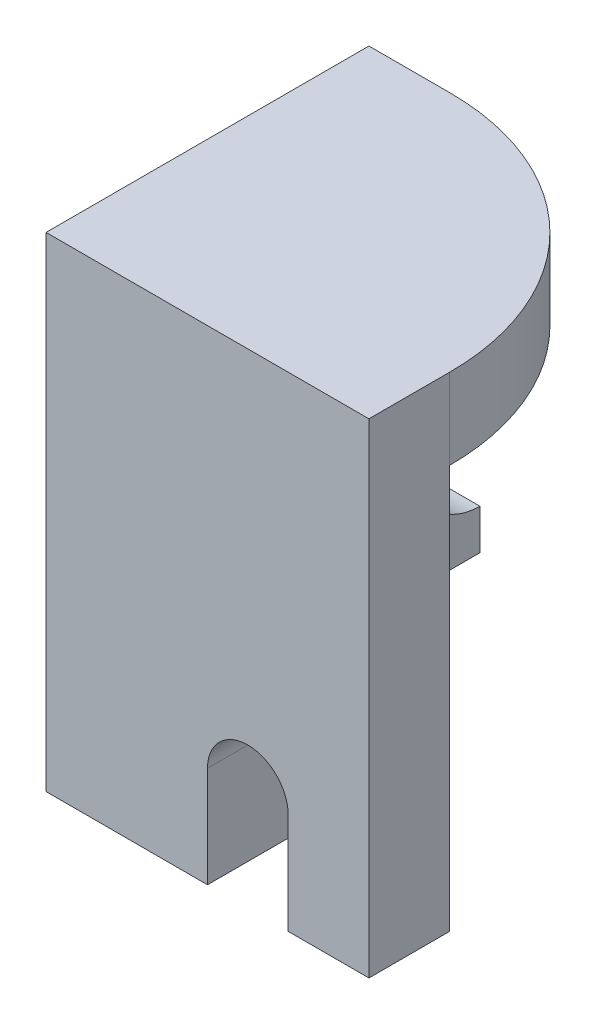
ISO-10303-21;
HEADER;
FILE_DESCRIPTION(('STEP AP214'),'2;1');
FILE_NAME('part.step','',(''),(''),'','','');
FILE_SCHEMA(('AUTOMOTIVE_DESIGN { 1 0 10303 214 1 1 1 1 }'));
ENDSEC;
DATA;
#1=APPLICATION_CONTEXT('core data for automotive mechanical design processes');
#2=APPLICATION_PROTOCOL_DEFINITION('international standard','automotive_design',2000,#1);
#3=PRODUCT_CONTEXT('',#1,'mechanical');
#4=PRODUCT('Part','Part','',(#3));
#5=PRODUCT_RELATED_PRODUCT_CATEGORY('part','',(#4));
#6=PRODUCT_DEFINITION_FORMATION('','',#4);
#7=PRODUCT_DEFINITION_CONTEXT('part definition',#1,'design');
#8=PRODUCT_DEFINITION('design','',#6,#7);
#9=PRODUCT_DEFINITION_SHAPE('','',#8);
#10=(LENGTH_UNIT() NAMED_UNIT(*) SI_UNIT(.MILLI.,.METRE.));
#11=(NAMED_UNIT(*) PLANE_ANGLE_UNIT() SI_UNIT($,.RADIAN.));
#12=(NAMED_UNIT(*) SI_UNIT($,.STERADIAN.) SOLID_ANGLE_UNIT());
#13=UNCERTAINTY_MEASURE_WITH_UNIT(LENGTH_MEASURE(1.E-05),#10,'distance_accuracy_value','');
#14=(GEOMETRIC_REPRESENTATION_CONTEXT(3) GLOBAL_UNCERTAINTY_ASSIGNED_CONTEXT((#13)) GLOBAL_UNIT_ASSIGNED_CONTEXT((#10,
#11,#12)) REPRESENTATION_CONTEXT('',''));
#15=CARTESIAN_POINT('',(0.,0.,0.));
#16=DIRECTION('',(0.,0.,1.));
#17=DIRECTION('',(1.,0.,0.));
#18=AXIS2_PLACEMENT_3D('',#15,#16,#17);
#19=CARTESIAN_POINT('',(0.,0.,-12.));
#20=DIRECTION('',(0.,0.,1.));
#21=DIRECTION('',(1.,0.,0.));
#22=AXIS2_PLACEMENT_3D('',#19,#20,#21);
#23=PLANE('',#22);
#24=DIRECTION('',(0.,1.,0.));
#25=VECTOR('',#24,1.);
#26=CARTESIAN_POINT('',(-32.,0.,-12.));
#27=LINE('',#26,#25);
#28=CARTESIAN_POINT('',(-32.,-40.,-12.));
#29=VERTEX_POINT('',#28);
#30=CARTESIAN_POINT('',(-32.,-32.,-12.));
#31=VERTEX_POINT('',#30);
#32=EDGE_CURVE('E333',#29,#31,#27,.T.);
#33=ORIENTED_EDGE('',*,*,#32,.T.);
#34=DIRECTION('',(1.,0.,0.));
#35=VECTOR('',#34,1.);
#36=CARTESIAN_POINT('',(-41.,-32.,-12.));
#37=LINE('',#36,#35);
#38=CARTESIAN_POINT('',(9.99999999999998,-32.,-12.));
#39=VERTEX_POINT('',#38);
#40=EDGE_CURVE('E11',#31,#39,#37,.T.);
#41=ORIENTED_EDGE('',*,*,#40,.T.);
#42=DIRECTION('',(0.,-1.,0.));
#43=VECTOR('',#42,1.);
#44=CARTESIAN_POINT('',(9.99999999999999,0.,-12.));
#45=LINE('',#44,#43);
#46=CARTESIAN_POINT('',(9.99999999999998,-40.,-12.));
#47=VERTEX_POINT('',#46);
#48=EDGE_CURVE('E194',#39,#47,#45,.T.);
#49=ORIENTED_EDGE('',*,*,#48,.T.);
#50=DIRECTION('',(-1.,0.,0.));
#51=VECTOR('',#50,1.);
#52=CARTESIAN_POINT('',(-32.,-40.,-12.));
#53=LINE('',#52,#51);
#54=CARTESIAN_POINT('',(-20.,-40.,-12.));
#55=VERTEX_POINT('',#54);
#56=EDGE_CURVE('E189',#47,#55,#53,.T.);
#57=ORIENTED_EDGE('',*,*,#56,.T.);
#58=DIRECTION('',(-1.,0.,0.));
#59=VECTOR('',#58,1.);
#60=CARTESIAN_POINT('',(-20.,-40.,-12.));
#61=LINE('',#60,#59);
#62=EDGE_CURVE('E161',#55,#29,#61,.T.);
#63=ORIENTED_EDGE('',*,*,#62,.T.);
#64=EDGE_LOOP('',(#33,#41,#49,#57,#63));
#65=FACE_BOUND('',#64,.T.);
#66=ADVANCED_FACE('F43',(#65),#23,.F.);
#67=CARTESIAN_POINT('',(-16.,0.,16.));
#68=DIRECTION('',(0.,1.,0.));
#69=DIRECTION('',(0.,0.,1.));
#70=AXIS2_PLACEMENT_3D('',#67,#68,#69);
#71=PLANE('',#70);
#72=DIRECTION('',(0.,0.,1.));
#73=VECTOR('',#72,1.);
#74=CARTESIAN_POINT('',(9.99999999999999,0.,-12.));
#75=LINE('',#74,#73);
#76=CARTESIAN_POINT('',(9.99999999999998,0.,-12.));
#77=VERTEX_POINT('',#76);
#78=CARTESIAN_POINT('',(9.99999999999998,0.,16.));
#79=VERTEX_POINT('',#78);
#80=EDGE_CURVE('E67',#77,#79,#75,.T.);
#81=ORIENTED_EDGE('',*,*,#80,.F.);
#82=DIRECTION('',(1.,0.,0.));
#83=VECTOR('',#82,1.);
#84=CARTESIAN_POINT('',(-32.,0.,-12.));
#85=LINE('',#84,#83);
#86=CARTESIAN_POINT('',(-32.,0.,-12.));
#87=VERTEX_POINT('',#86);
#88=EDGE_CURVE('E336',#87,#77,#85,.T.);
#89=ORIENTED_EDGE('',*,*,#88,.F.);
#90=DIRECTION('',(0.,0.,1.));
#91=VECTOR('',#90,1.);
#92=CARTESIAN_POINT('',(-32.,0.,-32.));
#93=LINE('',#92,#91);
#94=CARTESIAN_POINT('',(-32.,0.,-32.));
#95=VERTEX_POINT('',#94);
#96=EDGE_CURVE('E277',#95,#87,#93,.T.);
#97=ORIENTED_EDGE('',*,*,#96,.F.);
#98=DIRECTION('',(-1.,0.,0.));
#99=VECTOR('',#98,1.);
#100=CARTESIAN_POINT('',(-32.,0.,-32.));
#101=LINE('',#100,#99);
#102=CARTESIAN_POINT('',(-16.,0.,-32.));
#103=VERTEX_POINT('',#102);
#104=EDGE_CURVE('E292',#103,#95,#101,.T.);
#105=ORIENTED_EDGE('',*,*,#104,.F.);
#106=CARTESIAN_POINT('',(-16.,0.,16.));
#107=DIRECTION('',(0.,1.,0.));
#108=DIRECTION('',(0.,0.,1.));
#109=AXIS2_PLACEMENT_3D('',#106,#107,#108);
#110=CIRCLE('',#109,48.);
#111=CARTESIAN_POINT('',(32.,0.,16.));
#112=VERTEX_POINT('',#111);
#113=EDGE_CURVE('E271',#112,#103,#110,.T.);
#114=ORIENTED_EDGE('',*,*,#113,.F.);
#115=DIRECTION('',(1.,0.,0.));
#116=VECTOR('',#115,1.);
#117=CARTESIAN_POINT('',(32.,0.,16.));
#118=LINE('',#117,#116);
#119=EDGE_CURVE('E245',#79,#112,#118,.T.);
#120=ORIENTED_EDGE('',*,*,#119,.F.);
#121=EDGE_LOOP('',(#81,#89,#97,#105,#114,#120));
#122=FACE_BOUND('',#121,.T.);
#123=ADVANCED_FACE('F369',(#122),#71,.F.);
#124=CARTESIAN_POINT('',(32.,-80.,16.));
#125=DIRECTION('',(0.,0.,1.));
#126=DIRECTION('',(1.,0.,0.));
#127=AXIS2_PLACEMENT_3D('',#124,#125,#126);
#128=PLANE('',#127);
#129=DIRECTION('',(1.,0.,0.));
#130=VECTOR('',#129,1.);
#131=CARTESIAN_POINT('',(32.,-80.,16.));
#132=LINE('',#131,#130);
#133=CARTESIAN_POINT('',(-20.,-80.,16.));
#134=VERTEX_POINT('',#133);
#135=CARTESIAN_POINT('',(0.,-80.,16.));
#136=VERTEX_POINT('',#135);
#137=EDGE_CURVE('E265',#134,#136,#132,.T.);
#138=ORIENTED_EDGE('',*,*,#137,.F.);
#139=DIRECTION('',(0.,1.,0.));
#140=VECTOR('',#139,1.);
#141=CARTESIAN_POINT('',(-20.,-80.,16.));
#142=LINE('',#141,#140);
#143=CARTESIAN_POINT('',(-20.,-40.,16.));
#144=VERTEX_POINT('',#143);
#145=EDGE_CURVE('E174',#134,#144,#142,.T.);
#146=ORIENTED_EDGE('',*,*,#145,.T.);
#147=DIRECTION('',(-1.,0.,0.));
#148=VECTOR('',#147,1.);
#149=CARTESIAN_POINT('',(-32.,-40.,16.));
#150=LINE('',#149,#148);
#151=CARTESIAN_POINT('',(9.99999999999998,-40.,16.));
#152=VERTEX_POINT('',#151);
#153=EDGE_CURVE('E190',#152,#144,#150,.T.);
#154=ORIENTED_EDGE('',*,*,#153,.F.);
#155=DIRECTION('',(0.,-1.,0.));
#156=VECTOR('',#155,1.);
#157=CARTESIAN_POINT('',(9.99999999999998,0.,16.));
#158=LINE('',#157,#156);
#159=EDGE_CURVE('E207',#79,#152,#158,.T.);
#160=ORIENTED_EDGE('',*,*,#159,.F.);
#161=ORIENTED_EDGE('',*,*,#119,.T.);
#162=DIRECTION('',(0.,1.,0.));
#163=VECTOR('',#162,1.);
#164=CARTESIAN_POINT('',(32.,-80.,16.));
#165=LINE('',#164,#163);
#166=CARTESIAN_POINT('',(32.,-80.,16.));
#167=VERTEX_POINT('',#166);
#168=EDGE_CURVE('E264',#167,#112,#165,.T.);
#169=ORIENTED_EDGE('',*,*,#168,.F.);
#170=CARTESIAN_POINT('',(16.,-80.,16.));
#171=VERTEX_POINT('',#170);
#172=EDGE_CURVE('E259',#171,#167,#132,.T.);
#173=ORIENTED_EDGE('',*,*,#172,.F.);
#174=DIRECTION('',(0.,-1.,0.));
#175=VECTOR('',#174,1.);
#176=CARTESIAN_POINT('',(16.,-80.,16.));
#177=LINE('',#176,#175);
#178=CARTESIAN_POINT('',(16.,-60.,16.));
#179=VERTEX_POINT('',#178);
#180=EDGE_CURVE('E216',#179,#171,#177,.T.);
#181=ORIENTED_EDGE('',*,*,#180,.F.);
#182=CARTESIAN_POINT('',(8.,-60.,16.));
#183=DIRECTION('',(0.,0.,-1.));
#184=DIRECTION('',(-1.,0.,0.));
#185=AXIS2_PLACEMENT_3D('',#182,#183,#184);
#186=CIRCLE('',#185,8.);
#187=CARTESIAN_POINT('',(0.,-60.,16.));
#188=VERTEX_POINT('',#187);
#189=EDGE_CURVE('E223',#188,#179,#186,.T.);
#190=ORIENTED_EDGE('',*,*,#189,.F.);
#191=DIRECTION('',(0.,1.,0.));
#192=VECTOR('',#191,1.);
#193=CARTESIAN_POINT('',(0.,-80.,16.));
#194=LINE('',#193,#192);
#195=EDGE_CURVE('E219',#136,#188,#194,.T.);
#196=ORIENTED_EDGE('',*,*,#195,.F.);
#197=EDGE_LOOP('',(#138,#146,#154,#160,#161,#169,#173,#181,#190,#196));
#198=FACE_BOUND('',#197,.T.);
#199=ADVANCED_FACE('F350',(#198),#128,.F.);
#200=CARTESIAN_POINT('',(0.,-80.,0.));
#201=DIRECTION('',(0.,1.,0.));
#202=DIRECTION('',(0.,0.,1.));
#203=AXIS2_PLACEMENT_3D('',#200,#201,#202);
#204=PLANE('',#203);
#205=DIRECTION('',(-1.,0.,0.));
#206=VECTOR('',#205,1.);
#207=CARTESIAN_POINT('',(32.,-80.,32.));
#208=LINE('',#207,#206);
#209=CARTESIAN_POINT('',(32.,-80.,32.));
#210=VERTEX_POINT('',#209);
#211=CARTESIAN_POINT('',(16.,-80.,32.));
#212=VERTEX_POINT('',#211);
#213=EDGE_CURVE('E251',#210,#212,#208,.T.);
#214=ORIENTED_EDGE('',*,*,#213,.T.);
#215=DIRECTION('',(0.,0.,-1.));
#216=VECTOR('',#215,1.);
#217=CARTESIAN_POINT('',(16.,-80.,0.));
#218=LINE('',#217,#216);
#219=EDGE_CURVE('E320',#212,#171,#218,.T.);
#220=ORIENTED_EDGE('',*,*,#219,.T.);
#221=ORIENTED_EDGE('',*,*,#172,.T.);
#222=DIRECTION('',(0.,0.,1.));
#223=VECTOR('',#222,1.);
#224=CARTESIAN_POINT('',(32.,-80.,32.));
#225=LINE('',#224,#223);
#226=EDGE_CURVE('E246',#167,#210,#225,.T.);
#227=ORIENTED_EDGE('',*,*,#226,.T.);
#228=EDGE_LOOP('',(#214,#220,#221,#227));
#229=FACE_BOUND('',#228,.T.);
#230=ADVANCED_FACE('F394',(#229),#204,.F.);
#231=CARTESIAN_POINT('',(32.,16.,16.));
#232=DIRECTION('',(-1.,0.,0.));
#233=DIRECTION('',(0.,0.,1.));
#234=AXIS2_PLACEMENT_3D('',#231,#232,#233);
#235=PLANE('',#234);
#236=DIRECTION('',(0.,-1.,0.));
#237=VECTOR('',#236,1.);
#238=CARTESIAN_POINT('',(32.,16.,32.));
#239=LINE('',#238,#237);
#240=CARTESIAN_POINT('',(32.,16.,32.));
#241=VERTEX_POINT('',#240);
#242=EDGE_CURVE('E289',#241,#210,#239,.T.);
#243=ORIENTED_EDGE('',*,*,#242,.T.);
#244=ORIENTED_EDGE('',*,*,#226,.F.);
#245=ORIENTED_EDGE('',*,*,#168,.T.);
#246=DIRECTION('',(0.,-1.,0.));
#247=VECTOR('',#246,1.);
#248=CARTESIAN_POINT('',(32.,16.,16.));
#249=LINE('',#248,#247);
#250=CARTESIAN_POINT('',(32.,16.,16.));
#251=VERTEX_POINT('',#250);
#252=EDGE_CURVE('E312',#251,#112,#249,.T.);
#253=ORIENTED_EDGE('',*,*,#252,.F.);
#254=DIRECTION('',(0.,0.,-1.));
#255=VECTOR('',#254,1.);
#256=CARTESIAN_POINT('',(32.,16.,16.));
#257=LINE('',#256,#255);
#258=EDGE_CURVE('E272',#241,#251,#257,.T.);
#259=ORIENTED_EDGE('',*,*,#258,.F.);
#260=EDGE_LOOP('',(#243,#244,#245,#253,#259));
#261=FACE_BOUND('',#260,.T.);
#262=ADVANCED_FACE('F45',(#261),#235,.F.);
#263=CARTESIAN_POINT('',(-16.,16.,16.));
#264=DIRECTION('',(0.,-1.,0.));
#265=DIRECTION('',(0.,0.,-1.));
#266=AXIS2_PLACEMENT_3D('',#263,#264,#265);
#267=CYLINDRICAL_SURFACE('',#266,48.);
#268=ORIENTED_EDGE('',*,*,#113,.T.);
#269=DIRECTION('',(0.,-1.,0.));
#270=VECTOR('',#269,1.);
#271=CARTESIAN_POINT('',(-16.,16.,-32.));
#272=LINE('',#271,#270);
#273=CARTESIAN_POINT('',(-16.,16.,-32.));
#274=VERTEX_POINT('',#273);
#275=EDGE_CURVE('E308',#274,#103,#272,.T.);
#276=ORIENTED_EDGE('',*,*,#275,.F.);
#277=CARTESIAN_POINT('',(-16.,16.,16.));
#278=DIRECTION('',(0.,1.,0.));
#279=DIRECTION('',(0.,0.,1.));
#280=AXIS2_PLACEMENT_3D('',#277,#278,#279);
#281=CIRCLE('',#280,48.);
#282=EDGE_CURVE('E276',#251,#274,#281,.T.);
#283=ORIENTED_EDGE('',*,*,#282,.F.);
#284=ORIENTED_EDGE('',*,*,#252,.T.);
#285=EDGE_LOOP('',(#268,#276,#283,#284));
#286=FACE_BOUND('',#285,.T.);
#287=ADVANCED_FACE('F408',(#286),#267,.T.);
#288=CARTESIAN_POINT('',(-32.,16.,-32.));
#289=DIRECTION('',(0.,0.,1.));
#290=DIRECTION('',(1.,0.,0.));
#291=AXIS2_PLACEMENT_3D('',#288,#289,#290);
#292=PLANE('',#291);
#293=ORIENTED_EDGE('',*,*,#104,.T.);
#294=DIRECTION('',(0.,-1.,0.));
#295=VECTOR('',#294,1.);
#296=CARTESIAN_POINT('',(-32.,16.,-32.));
#297=LINE('',#296,#295);
#298=CARTESIAN_POINT('',(-32.,16.,-32.));
#299=VERTEX_POINT('',#298);
#300=EDGE_CURVE('E304',#299,#95,#297,.T.);
#301=ORIENTED_EDGE('',*,*,#300,.F.);
#302=DIRECTION('',(-1.,0.,0.));
#303=VECTOR('',#302,1.);
#304=CARTESIAN_POINT('',(-32.,16.,-32.));
#305=LINE('',#304,#303);
#306=EDGE_CURVE('E280',#274,#299,#305,.T.);
#307=ORIENTED_EDGE('',*,*,#306,.F.);
#308=ORIENTED_EDGE('',*,*,#275,.T.);
#309=EDGE_LOOP('',(#293,#301,#307,#308));
#310=FACE_BOUND('',#309,.T.);
#311=ADVANCED_FACE('F406',(#310),#292,.F.);
#312=CARTESIAN_POINT('',(-32.,16.,-32.));
#313=DIRECTION('',(1.,0.,0.));
#314=DIRECTION('',(0.,0.,-1.));
#315=AXIS2_PLACEMENT_3D('',#312,#313,#314);
#316=PLANE('',#315);
#317=CARTESIAN_POINT('',(-32.,-8.,-12.));
#318=VERTEX_POINT('',#317);
#319=EDGE_CURVE('E212',#318,#87,#27,.T.);
#320=ORIENTED_EDGE('',*,*,#319,.F.);
#321=CARTESIAN_POINT('',(-32.,-20.,-12.));
#322=DIRECTION('',(1.,0.,0.));
#323=DIRECTION('',(0.,0.,-1.));
#324=AXIS2_PLACEMENT_3D('',#321,#322,#323);
#325=CIRCLE('',#324,12.);
#326=EDGE_CURVE('E59',#318,#31,#325,.T.);
#327=ORIENTED_EDGE('',*,*,#326,.T.);
#328=ORIENTED_EDGE('',*,*,#32,.F.);
#329=DIRECTION('',(0.,-0.819231920519041,0.573462344363328));
#330=VECTOR('',#329,1.);
#331=CARTESIAN_POINT('',(-32.,-40.,-12.));
#332=LINE('',#331,#330);
#333=CARTESIAN_POINT('',(-32.,-80.,16.));
#334=VERTEX_POINT('',#333);
#335=EDGE_CURVE('E167',#29,#334,#332,.T.);
#336=ORIENTED_EDGE('',*,*,#335,.T.);
#337=DIRECTION('',(0.,0.,-1.));
#338=VECTOR('',#337,1.);
#339=CARTESIAN_POINT('',(-32.,-80.,32.));
#340=LINE('',#339,#338);
#341=CARTESIAN_POINT('',(-32.,-80.,32.));
#342=VERTEX_POINT('',#341);
#343=EDGE_CURVE('E255',#342,#334,#340,.T.);
#344=ORIENTED_EDGE('',*,*,#343,.F.);
#345=DIRECTION('',(0.,-1.,0.));
#346=VECTOR('',#345,1.);
#347=CARTESIAN_POINT('',(-32.,16.,32.));
#348=LINE('',#347,#346);
#349=CARTESIAN_POINT('',(-32.,16.,32.));
#350=VERTEX_POINT('',#349);
#351=EDGE_CURVE('E300',#350,#342,#348,.T.);
#352=ORIENTED_EDGE('',*,*,#351,.F.);
#353=DIRECTION('',(0.,0.,1.));
#354=VECTOR('',#353,1.);
#355=CARTESIAN_POINT('',(-32.,16.,-32.));
#356=LINE('',#355,#354);
#357=EDGE_CURVE('E283',#299,#350,#356,.T.);
#358=ORIENTED_EDGE('',*,*,#357,.F.);
#359=ORIENTED_EDGE('',*,*,#300,.T.);
#360=ORIENTED_EDGE('',*,*,#96,.T.);
#361=EDGE_LOOP('',(#320,#327,#328,#336,#344,#352,#358,#359,#360));
#362=FACE_BOUND('',#361,.T.);
#363=ADVANCED_FACE('F330',(#362),#316,.F.);
#364=CARTESIAN_POINT('',(-32.,16.,32.));
#365=DIRECTION('',(0.,0.,-1.));
#366=DIRECTION('',(-1.,0.,0.));
#367=AXIS2_PLACEMENT_3D('',#364,#365,#366);
#368=PLANE('',#367);
#369=CARTESIAN_POINT('',(8.,-60.,32.));
#370=DIRECTION('',(0.,0.,-1.));
#371=DIRECTION('',(-1.,0.,0.));
#372=AXIS2_PLACEMENT_3D('',#369,#370,#371);
#373=CIRCLE('',#372,8.);
#374=CARTESIAN_POINT('',(0.,-60.,32.));
#375=VERTEX_POINT('',#374);
#376=CARTESIAN_POINT('',(16.,-60.,32.));
#377=VERTEX_POINT('',#376);
#378=EDGE_CURVE('E241',#375,#377,#373,.T.);
#379=ORIENTED_EDGE('',*,*,#378,.T.);
#380=DIRECTION('',(0.,-1.,0.));
#381=VECTOR('',#380,1.);
#382=CARTESIAN_POINT('',(16.,16.,32.));
#383=LINE('',#382,#381);
#384=EDGE_CURVE('E237',#377,#212,#383,.T.);
#385=ORIENTED_EDGE('',*,*,#384,.T.);
#386=ORIENTED_EDGE('',*,*,#213,.F.);
#387=ORIENTED_EDGE('',*,*,#242,.F.);
#388=DIRECTION('',(1.,0.,0.));
#389=VECTOR('',#388,1.);
#390=CARTESIAN_POINT('',(-32.,16.,32.));
#391=LINE('',#390,#389);
#392=EDGE_CURVE('E286',#350,#241,#391,.T.);
#393=ORIENTED_EDGE('',*,*,#392,.F.);
#394=ORIENTED_EDGE('',*,*,#351,.T.);
#395=CARTESIAN_POINT('',(0.,-80.,32.));
#396=VERTEX_POINT('',#395);
#397=EDGE_CURVE('E250',#396,#342,#208,.T.);
#398=ORIENTED_EDGE('',*,*,#397,.F.);
#399=DIRECTION('',(0.,1.,0.));
#400=VECTOR('',#399,1.);
#401=CARTESIAN_POINT('',(0.,16.,32.));
#402=LINE('',#401,#400);
#403=EDGE_CURVE('E231',#396,#375,#402,.T.);
#404=ORIENTED_EDGE('',*,*,#403,.T.);
#405=EDGE_LOOP('',(#379,#385,#386,#387,#393,#394,#398,#404));
#406=FACE_BOUND('',#405,.T.);
#407=ADVANCED_FACE('F398',(#406),#368,.F.);
#408=CARTESIAN_POINT('',(-16.,16.,16.));
#409=DIRECTION('',(0.,1.,0.));
#410=DIRECTION('',(0.,0.,1.));
#411=AXIS2_PLACEMENT_3D('',#408,#409,#410);
#412=PLANE('',#411);
#413=ORIENTED_EDGE('',*,*,#258,.T.);
#414=ORIENTED_EDGE('',*,*,#282,.T.);
#415=ORIENTED_EDGE('',*,*,#306,.T.);
#416=ORIENTED_EDGE('',*,*,#357,.T.);
#417=ORIENTED_EDGE('',*,*,#392,.T.);
#418=EDGE_LOOP('',(#413,#414,#415,#416,#417));
#419=FACE_BOUND('',#418,.T.);
#420=ADVANCED_FACE('F393',(#419),#412,.T.);
#421=EDGE_CURVE('E260',#334,#134,#132,.T.);
#422=ORIENTED_EDGE('',*,*,#421,.T.);
#423=ORIENTED_EDGE('',*,*,#137,.T.);
#424=DIRECTION('',(0.,0.,1.));
#425=VECTOR('',#424,1.);
#426=CARTESIAN_POINT('',(0.,-80.,0.));
#427=LINE('',#426,#425);
#428=EDGE_CURVE('E316',#136,#396,#427,.T.);
#429=ORIENTED_EDGE('',*,*,#428,.T.);
#430=ORIENTED_EDGE('',*,*,#397,.T.);
#431=ORIENTED_EDGE('',*,*,#343,.T.);
#432=EDGE_LOOP('',(#422,#423,#429,#430,#431));
#433=FACE_BOUND('',#432,.T.);
#434=ADVANCED_FACE('F356',(#433),#204,.F.);
#435=CARTESIAN_POINT('',(7.99999999999999,-60.,96.));
#436=DIRECTION('',(0.,0.,-1.));
#437=DIRECTION('',(-1.,0.,0.));
#438=AXIS2_PLACEMENT_3D('',#435,#436,#437);
#439=CYLINDRICAL_SURFACE('',#438,8.);
#440=DIRECTION('',(0.,0.,-1.));
#441=VECTOR('',#440,1.);
#442=CARTESIAN_POINT('',(0.,-60.,96.));
#443=LINE('',#442,#441);
#444=EDGE_CURVE('E227',#375,#188,#443,.T.);
#445=ORIENTED_EDGE('',*,*,#444,.T.);
#446=ORIENTED_EDGE('',*,*,#189,.T.);
#447=DIRECTION('',(0.,0.,-1.));
#448=VECTOR('',#447,1.);
#449=CARTESIAN_POINT('',(16.,-60.,96.));
#450=LINE('',#449,#448);
#451=EDGE_CURVE('E228',#377,#179,#450,.T.);
#452=ORIENTED_EDGE('',*,*,#451,.F.);
#453=ORIENTED_EDGE('',*,*,#378,.F.);
#454=EDGE_LOOP('',(#445,#446,#452,#453));
#455=FACE_BOUND('',#454,.T.);
#456=ADVANCED_FACE('F380',(#455),#439,.F.);
#457=CARTESIAN_POINT('',(16.,-80.,96.));
#458=DIRECTION('',(1.,0.,0.));
#459=DIRECTION('',(0.,0.,-1.));
#460=AXIS2_PLACEMENT_3D('',#457,#458,#459);
#461=PLANE('',#460);
#462=ORIENTED_EDGE('',*,*,#451,.T.);
#463=ORIENTED_EDGE('',*,*,#180,.T.);
#464=ORIENTED_EDGE('',*,*,#219,.F.);
#465=ORIENTED_EDGE('',*,*,#384,.F.);
#466=EDGE_LOOP('',(#462,#463,#464,#465));
#467=FACE_BOUND('',#466,.T.);
#468=ADVANCED_FACE('F383',(#467),#461,.F.);
#469=CARTESIAN_POINT('',(0.,-80.,96.));
#470=DIRECTION('',(-1.,0.,0.));
#471=DIRECTION('',(0.,-1.,0.));
#472=AXIS2_PLACEMENT_3D('',#469,#470,#471);
#473=PLANE('',#472);
#474=ORIENTED_EDGE('',*,*,#428,.F.);
#475=ORIENTED_EDGE('',*,*,#195,.T.);
#476=ORIENTED_EDGE('',*,*,#444,.F.);
#477=ORIENTED_EDGE('',*,*,#403,.F.);
#478=EDGE_LOOP('',(#474,#475,#476,#477));
#479=FACE_BOUND('',#478,.T.);
#480=ADVANCED_FACE('F379',(#479),#473,.F.);
#481=CARTESIAN_POINT('',(9.99999999999999,0.,-12.));
#482=DIRECTION('',(-1.,0.,0.));
#483=DIRECTION('',(0.,0.,1.));
#484=AXIS2_PLACEMENT_3D('',#481,#482,#483);
#485=PLANE('',#484);
#486=ORIENTED_EDGE('',*,*,#48,.F.);
#487=CARTESIAN_POINT('',(9.99999999999998,-20.,-12.));
#488=DIRECTION('',(1.,0.,0.));
#489=DIRECTION('',(0.,0.,-1.));
#490=AXIS2_PLACEMENT_3D('',#487,#488,#489);
#491=CIRCLE('',#490,12.);
#492=CARTESIAN_POINT('',(9.99999999999999,-8.,-12.));
#493=VERTEX_POINT('',#492);
#494=EDGE_CURVE('E173',#493,#39,#491,.T.);
#495=ORIENTED_EDGE('',*,*,#494,.F.);
#496=EDGE_CURVE('E198',#77,#493,#45,.T.);
#497=ORIENTED_EDGE('',*,*,#496,.F.);
#498=ORIENTED_EDGE('',*,*,#80,.T.);
#499=ORIENTED_EDGE('',*,*,#159,.T.);
#500=DIRECTION('',(0.,0.,1.));
#501=VECTOR('',#500,1.);
#502=CARTESIAN_POINT('',(9.99999999999998,-40.,-12.));
#503=LINE('',#502,#501);
#504=EDGE_CURVE('E197',#47,#152,#503,.T.);
#505=ORIENTED_EDGE('',*,*,#504,.F.);
#506=EDGE_LOOP('',(#486,#495,#497,#498,#499,#505));
#507=FACE_BOUND('',#506,.T.);
#508=ADVANCED_FACE('F342',(#507),#485,.F.);
#509=CARTESIAN_POINT('',(-32.,-40.,-12.));
#510=DIRECTION('',(0.,1.,0.));
#511=DIRECTION('',(0.,0.,1.));
#512=AXIS2_PLACEMENT_3D('',#509,#510,#511);
#513=PLANE('',#512);
#514=ORIENTED_EDGE('',*,*,#153,.T.);
#515=DIRECTION('',(0.,0.,-1.));
#516=VECTOR('',#515,1.);
#517=CARTESIAN_POINT('',(-20.,-40.,16.));
#518=LINE('',#517,#516);
#519=EDGE_CURVE('E179',#144,#55,#518,.T.);
#520=ORIENTED_EDGE('',*,*,#519,.T.);
#521=ORIENTED_EDGE('',*,*,#56,.F.);
#522=ORIENTED_EDGE('',*,*,#504,.T.);
#523=EDGE_LOOP('',(#514,#520,#521,#522));
#524=FACE_BOUND('',#523,.T.);
#525=ADVANCED_FACE('F187',(#524),#513,.F.);
#526=ORIENTED_EDGE('',*,*,#496,.T.);
#527=DIRECTION('',(1.,0.,0.));
#528=VECTOR('',#527,1.);
#529=CARTESIAN_POINT('',(-41.,-8.,-12.));
#530=LINE('',#529,#528);
#531=EDGE_CURVE('E52',#493,#318,#530,.F.);
#532=ORIENTED_EDGE('',*,*,#531,.T.);
#533=ORIENTED_EDGE('',*,*,#319,.T.);
#534=ORIENTED_EDGE('',*,*,#88,.T.);
#535=EDGE_LOOP('',(#526,#532,#533,#534));
#536=FACE_BOUND('',#535,.T.);
#537=ADVANCED_FACE('F326',(#536),#23,.F.);
#538=CARTESIAN_POINT('',(-41.,-20.,-12.));
#539=DIRECTION('',(1.,0.,0.));
#540=DIRECTION('',(0.,0.,-1.));
#541=AXIS2_PLACEMENT_3D('',#538,#539,#540);
#542=CYLINDRICAL_SURFACE('',#541,12.);
#543=ORIENTED_EDGE('',*,*,#326,.F.);
#544=ORIENTED_EDGE('',*,*,#531,.F.);
#545=ORIENTED_EDGE('',*,*,#494,.T.);
#546=ORIENTED_EDGE('',*,*,#40,.F.);
#547=EDGE_LOOP('',(#543,#544,#545,#546));
#548=FACE_BOUND('',#547,.T.);
#549=ADVANCED_FACE('F359',(#548),#542,.F.);
#550=CARTESIAN_POINT('',(-20.,-40.,-12.));
#551=DIRECTION('',(0.,-0.573462344363328,-0.819231920519041));
#552=DIRECTION('',(0.,0.819231920519041,-0.573462344363328));
#553=AXIS2_PLACEMENT_3D('',#550,#551,#552);
#554=PLANE('',#553);
#555=ORIENTED_EDGE('',*,*,#335,.F.);
#556=ORIENTED_EDGE('',*,*,#62,.F.);
#557=DIRECTION('',(0.,-0.819231920519041,0.573462344363328));
#558=VECTOR('',#557,1.);
#559=CARTESIAN_POINT('',(-20.,-40.,-12.));
#560=LINE('',#559,#558);
#561=EDGE_CURVE('E164',#55,#134,#560,.T.);
#562=ORIENTED_EDGE('',*,*,#561,.T.);
#563=ORIENTED_EDGE('',*,*,#421,.F.);
#564=EDGE_LOOP('',(#555,#556,#562,#563));
#565=FACE_BOUND('',#564,.T.);
#566=ADVANCED_FACE('F163',(#565),#554,.T.);
#567=CARTESIAN_POINT('',(-20.,0.,0.));
#568=DIRECTION('',(1.,0.,0.));
#569=DIRECTION('',(0.,0.,-1.));
#570=AXIS2_PLACEMENT_3D('',#567,#568,#569);
#571=PLANE('',#570);
#572=ORIENTED_EDGE('',*,*,#519,.F.);
#573=ORIENTED_EDGE('',*,*,#145,.F.);
#574=ORIENTED_EDGE('',*,*,#561,.F.);
#575=EDGE_LOOP('',(#572,#573,#574));
#576=FACE_BOUND('',#575,.T.);
#577=ADVANCED_FACE('F178',(#576),#571,.T.);
#578=CLOSED_SHELL('',(#66,#123,#199,#230,#262,#287,#311,#363,#407,#420,#434,#456,#468,#480,#508,
#525,#537,#549,#566,#577));
#579=MANIFOLD_SOLID_BREP('B2',#578);
#580=ADVANCED_BREP_SHAPE_REPRESENTATION('',(#18,#579),#14);
#581=SHAPE_DEFINITION_REPRESENTATION(#9,#580);
ENDSEC;
END-ISO-10303-21;
